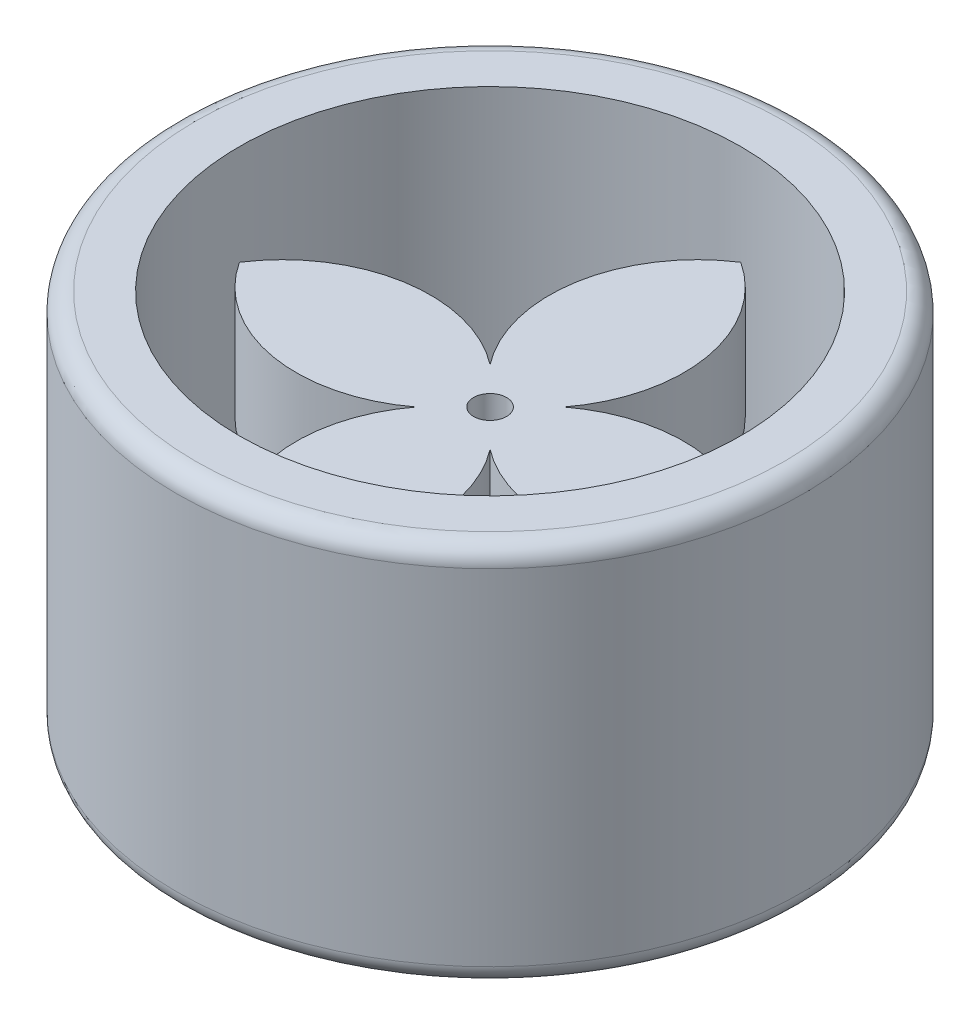
ISO-10303-21;
HEADER;
FILE_DESCRIPTION(('STEP AP214'),'2;1');
FILE_NAME('part.step','',(''),(''),'','','');
FILE_SCHEMA(('AUTOMOTIVE_DESIGN { 1 0 10303 214 1 1 1 1 }'));
ENDSEC;
DATA;
#1=APPLICATION_CONTEXT('core data for automotive mechanical design processes');
#2=APPLICATION_PROTOCOL_DEFINITION('international standard','automotive_design',2000,#1);
#3=PRODUCT_CONTEXT('',#1,'mechanical');
#4=PRODUCT('Part','Part','',(#3));
#5=PRODUCT_RELATED_PRODUCT_CATEGORY('part','',(#4));
#6=PRODUCT_DEFINITION_FORMATION('','',#4);
#7=PRODUCT_DEFINITION_CONTEXT('part definition',#1,'design');
#8=PRODUCT_DEFINITION('design','',#6,#7);
#9=PRODUCT_DEFINITION_SHAPE('','',#8);
#10=(LENGTH_UNIT() NAMED_UNIT(*) SI_UNIT(.MILLI.,.METRE.));
#11=(NAMED_UNIT(*) PLANE_ANGLE_UNIT() SI_UNIT($,.RADIAN.));
#12=(NAMED_UNIT(*) SI_UNIT($,.STERADIAN.) SOLID_ANGLE_UNIT());
#13=UNCERTAINTY_MEASURE_WITH_UNIT(LENGTH_MEASURE(1.E-05),#10,'distance_accuracy_value','');
#14=(GEOMETRIC_REPRESENTATION_CONTEXT(3) GLOBAL_UNCERTAINTY_ASSIGNED_CONTEXT((#13)) GLOBAL_UNIT_ASSIGNED_CONTEXT((#10,
#11,#12)) REPRESENTATION_CONTEXT('',''));
#15=CARTESIAN_POINT('',(0.,0.,0.));
#16=DIRECTION('',(0.,0.,1.));
#17=DIRECTION('',(1.,0.,0.));
#18=AXIS2_PLACEMENT_3D('',#15,#16,#17);
#19=CARTESIAN_POINT('',(20.2122260111009,174.137084989848,12.8907519493418));
#20=DIRECTION('',(0.,-1.,0.));
#21=DIRECTION('',(0.,0.,-1.));
#22=AXIS2_PLACEMENT_3D('',#19,#20,#21);
#23=CYLINDRICAL_SURFACE('',#22,23.6162546830612);
#24=DIRECTION('',(0.,-1.,0.));
#25=VECTOR('',#24,1.);
#26=CARTESIAN_POINT('',(5.87703014444037,174.137084989848,-5.87703014444033));
#27=LINE('',#26,#25);
#28=CARTESIAN_POINT('',(5.87703014444037,45.,-5.87703014444033));
#29=VERTEX_POINT('',#28);
#30=CARTESIAN_POINT('',(5.87703014444037,27.,-5.87703014444033));
#31=VERTEX_POINT('',#30);
#32=EDGE_CURVE('E101',#29,#31,#27,.T.);
#33=ORIENTED_EDGE('',*,*,#32,.F.);
#34=CARTESIAN_POINT('',(20.2122260111009,45.,12.8907519493418));
#35=DIRECTION('',(0.,1.,0.));
#36=DIRECTION('',(0.,0.,1.));
#37=AXIS2_PLACEMENT_3D('',#34,#35,#36);
#38=CIRCLE('',#37,23.6162546830612);
#39=CARTESIAN_POINT('',(40.,45.,0.));
#40=VERTEX_POINT('',#39);
#41=EDGE_CURVE('E156',#29,#40,#38,.F.);
#42=ORIENTED_EDGE('',*,*,#41,.T.);
#43=DIRECTION('',(0.,-1.,0.));
#44=VECTOR('',#43,1.);
#45=CARTESIAN_POINT('',(40.,174.137084989848,0.));
#46=LINE('',#45,#44);
#47=CARTESIAN_POINT('',(40.,27.,0.));
#48=VERTEX_POINT('',#47);
#49=EDGE_CURVE('E51',#40,#48,#46,.T.);
#50=ORIENTED_EDGE('',*,*,#49,.T.);
#51=CARTESIAN_POINT('',(20.2122260111009,27.,12.8907519493418));
#52=DIRECTION('',(0.,1.,0.));
#53=DIRECTION('',(0.,0.,1.));
#54=AXIS2_PLACEMENT_3D('',#51,#52,#53);
#55=CIRCLE('',#54,23.6162546830612);
#56=EDGE_CURVE('E181',#31,#48,#55,.F.);
#57=ORIENTED_EDGE('',*,*,#56,.F.);
#58=EDGE_LOOP('',(#33,#42,#50,#57));
#59=FACE_BOUND('',#58,.T.);
#60=ADVANCED_FACE('F47',(#59),#23,.T.);
#61=CARTESIAN_POINT('',(-12.8907519493418,174.137084989848,-20.2122260111009));
#62=DIRECTION('',(0.,-1.,0.));
#63=DIRECTION('',(0.,0.,-1.));
#64=AXIS2_PLACEMENT_3D('',#61,#62,#63);
#65=CYLINDRICAL_SURFACE('',#64,23.6162546830613);
#66=CARTESIAN_POINT('',(-12.8907519493418,45.,-20.2122260111009));
#67=DIRECTION('',(0.,1.,0.));
#68=DIRECTION('',(0.,0.,1.));
#69=AXIS2_PLACEMENT_3D('',#66,#67,#68);
#70=CIRCLE('',#69,23.6162546830613);
#71=CARTESIAN_POINT('',(0.,45.,-40.));
#72=VERTEX_POINT('',#71);
#73=EDGE_CURVE('E108',#29,#72,#70,.T.);
#74=ORIENTED_EDGE('',*,*,#73,.F.);
#75=ORIENTED_EDGE('',*,*,#32,.T.);
#76=CARTESIAN_POINT('',(-12.8907519493418,27.,-20.2122260111009));
#77=DIRECTION('',(0.,1.,0.));
#78=DIRECTION('',(0.,0.,1.));
#79=AXIS2_PLACEMENT_3D('',#76,#77,#78);
#80=CIRCLE('',#79,23.6162546830613);
#81=CARTESIAN_POINT('',(0.,27.,-40.));
#82=VERTEX_POINT('',#81);
#83=EDGE_CURVE('E153',#31,#82,#80,.T.);
#84=ORIENTED_EDGE('',*,*,#83,.T.);
#85=DIRECTION('',(0.,-1.,0.));
#86=VECTOR('',#85,1.);
#87=CARTESIAN_POINT('',(0.,174.137084989848,-40.));
#88=LINE('',#87,#86);
#89=EDGE_CURVE('E152',#72,#82,#88,.T.);
#90=ORIENTED_EDGE('',*,*,#89,.F.);
#91=EDGE_LOOP('',(#74,#75,#84,#90));
#92=FACE_BOUND('',#91,.T.);
#93=ADVANCED_FACE('F198',(#92),#65,.T.);
#94=CARTESIAN_POINT('',(12.8907519493418,174.137084989848,-20.2122260111009));
#95=DIRECTION('',(0.,-1.,0.));
#96=DIRECTION('',(0.,0.,-1.));
#97=AXIS2_PLACEMENT_3D('',#94,#95,#96);
#98=CYLINDRICAL_SURFACE('',#97,23.6162546830612);
#99=DIRECTION('',(0.,-1.,0.));
#100=VECTOR('',#99,1.);
#101=CARTESIAN_POINT('',(-5.87703014444033,174.137084989848,-5.87703014444033));
#102=LINE('',#101,#100);
#103=CARTESIAN_POINT('',(-5.87703014444033,45.,-5.87703014444033));
#104=VERTEX_POINT('',#103);
#105=CARTESIAN_POINT('',(-5.87703014444033,27.,-5.87703014444033));
#106=VERTEX_POINT('',#105);
#107=EDGE_CURVE('E160',#104,#106,#102,.T.);
#108=ORIENTED_EDGE('',*,*,#107,.F.);
#109=CARTESIAN_POINT('',(12.8907519493418,45.,-20.2122260111009));
#110=DIRECTION('',(0.,1.,0.));
#111=DIRECTION('',(0.,0.,1.));
#112=AXIS2_PLACEMENT_3D('',#109,#110,#111);
#113=CIRCLE('',#112,23.6162546830612);
#114=EDGE_CURVE('E150',#104,#72,#113,.F.);
#115=ORIENTED_EDGE('',*,*,#114,.T.);
#116=ORIENTED_EDGE('',*,*,#89,.T.);
#117=CARTESIAN_POINT('',(12.8907519493418,27.,-20.2122260111009));
#118=DIRECTION('',(0.,1.,0.));
#119=DIRECTION('',(0.,0.,1.));
#120=AXIS2_PLACEMENT_3D('',#117,#118,#119);
#121=CIRCLE('',#120,23.6162546830612);
#122=EDGE_CURVE('E155',#106,#82,#121,.F.);
#123=ORIENTED_EDGE('',*,*,#122,.F.);
#124=EDGE_LOOP('',(#108,#115,#116,#123));
#125=FACE_BOUND('',#124,.T.);
#126=ADVANCED_FACE('F196',(#125),#98,.T.);
#127=CARTESIAN_POINT('',(-20.2122260111009,174.137084989848,12.8907519493418));
#128=DIRECTION('',(0.,-1.,0.));
#129=DIRECTION('',(0.,0.,-1.));
#130=AXIS2_PLACEMENT_3D('',#127,#128,#129);
#131=CYLINDRICAL_SURFACE('',#130,23.6162546830612);
#132=CARTESIAN_POINT('',(-20.2122260111009,45.,12.8907519493418));
#133=DIRECTION('',(0.,1.,0.));
#134=DIRECTION('',(0.,0.,1.));
#135=AXIS2_PLACEMENT_3D('',#132,#133,#134);
#136=CIRCLE('',#135,23.6162546830612);
#137=CARTESIAN_POINT('',(-40.,45.,0.));
#138=VERTEX_POINT('',#137);
#139=EDGE_CURVE('E143',#104,#138,#136,.T.);
#140=ORIENTED_EDGE('',*,*,#139,.F.);
#141=ORIENTED_EDGE('',*,*,#107,.T.);
#142=CARTESIAN_POINT('',(-20.2122260111009,27.,12.8907519493418));
#143=DIRECTION('',(0.,1.,0.));
#144=DIRECTION('',(0.,0.,1.));
#145=AXIS2_PLACEMENT_3D('',#142,#143,#144);
#146=CIRCLE('',#145,23.6162546830612);
#147=CARTESIAN_POINT('',(-40.,27.,0.));
#148=VERTEX_POINT('',#147);
#149=EDGE_CURVE('E147',#106,#148,#146,.T.);
#150=ORIENTED_EDGE('',*,*,#149,.T.);
#151=DIRECTION('',(0.,-1.,0.));
#152=VECTOR('',#151,1.);
#153=CARTESIAN_POINT('',(-40.,174.137084989848,0.));
#154=LINE('',#153,#152);
#155=EDGE_CURVE('E146',#138,#148,#154,.T.);
#156=ORIENTED_EDGE('',*,*,#155,.F.);
#157=EDGE_LOOP('',(#140,#141,#150,#156));
#158=FACE_BOUND('',#157,.T.);
#159=ADVANCED_FACE('F200',(#158),#131,.T.);
#160=CARTESIAN_POINT('',(-20.2122260111009,174.137084989848,-12.8907519493418));
#161=DIRECTION('',(0.,-1.,0.));
#162=DIRECTION('',(0.,0.,-1.));
#163=AXIS2_PLACEMENT_3D('',#160,#161,#162);
#164=CYLINDRICAL_SURFACE('',#163,23.6162546830612);
#165=DIRECTION('',(0.,-1.,0.));
#166=VECTOR('',#165,1.);
#167=CARTESIAN_POINT('',(-5.87703014444032,174.137084989848,5.87703014444034));
#168=LINE('',#167,#166);
#169=CARTESIAN_POINT('',(-5.87703014444032,45.,5.87703014444034));
#170=VERTEX_POINT('',#169);
#171=CARTESIAN_POINT('',(-5.87703014444032,27.,5.87703014444034));
#172=VERTEX_POINT('',#171);
#173=EDGE_CURVE('E137',#170,#172,#168,.T.);
#174=ORIENTED_EDGE('',*,*,#173,.F.);
#175=CARTESIAN_POINT('',(-20.2122260111009,45.,-12.8907519493418));
#176=DIRECTION('',(0.,1.,0.));
#177=DIRECTION('',(0.,0.,1.));
#178=AXIS2_PLACEMENT_3D('',#175,#176,#177);
#179=CIRCLE('',#178,23.6162546830612);
#180=EDGE_CURVE('E144',#170,#138,#179,.F.);
#181=ORIENTED_EDGE('',*,*,#180,.T.);
#182=ORIENTED_EDGE('',*,*,#155,.T.);
#183=CARTESIAN_POINT('',(-20.2122260111009,27.,-12.8907519493418));
#184=DIRECTION('',(0.,1.,0.));
#185=DIRECTION('',(0.,0.,1.));
#186=AXIS2_PLACEMENT_3D('',#183,#184,#185);
#187=CIRCLE('',#186,23.6162546830612);
#188=EDGE_CURVE('E174',#172,#148,#187,.F.);
#189=ORIENTED_EDGE('',*,*,#188,.F.);
#190=EDGE_LOOP('',(#174,#181,#182,#189));
#191=FACE_BOUND('',#190,.T.);
#192=ADVANCED_FACE('F175',(#191),#164,.T.);
#193=CARTESIAN_POINT('',(12.8907519493419,174.137084989848,20.2122260111009));
#194=DIRECTION('',(0.,-1.,0.));
#195=DIRECTION('',(0.,0.,-1.));
#196=AXIS2_PLACEMENT_3D('',#193,#194,#195);
#197=CYLINDRICAL_SURFACE('',#196,23.6162546830612);
#198=CARTESIAN_POINT('',(12.8907519493419,45.,20.2122260111009));
#199=DIRECTION('',(0.,1.,0.));
#200=DIRECTION('',(0.,0.,1.));
#201=AXIS2_PLACEMENT_3D('',#198,#199,#200);
#202=CIRCLE('',#201,23.6162546830612);
#203=CARTESIAN_POINT('',(0.,45.,40.));
#204=VERTEX_POINT('',#203);
#205=EDGE_CURVE('E56',#170,#204,#202,.T.);
#206=ORIENTED_EDGE('',*,*,#205,.F.);
#207=ORIENTED_EDGE('',*,*,#173,.T.);
#208=CARTESIAN_POINT('',(12.8907519493419,27.,20.2122260111009));
#209=DIRECTION('',(0.,1.,0.));
#210=DIRECTION('',(0.,0.,1.));
#211=AXIS2_PLACEMENT_3D('',#208,#209,#210);
#212=CIRCLE('',#211,23.6162546830612);
#213=CARTESIAN_POINT('',(0.,27.,40.));
#214=VERTEX_POINT('',#213);
#215=EDGE_CURVE('E133',#172,#214,#212,.T.);
#216=ORIENTED_EDGE('',*,*,#215,.T.);
#217=DIRECTION('',(0.,-1.,0.));
#218=VECTOR('',#217,1.);
#219=CARTESIAN_POINT('',(0.,174.137084989848,40.));
#220=LINE('',#219,#218);
#221=EDGE_CURVE('E132',#204,#214,#220,.T.);
#222=ORIENTED_EDGE('',*,*,#221,.F.);
#223=EDGE_LOOP('',(#206,#207,#216,#222));
#224=FACE_BOUND('',#223,.T.);
#225=ADVANCED_FACE('F166',(#224),#197,.T.);
#226=CARTESIAN_POINT('',(-12.8907519493418,174.137084989848,20.2122260111009));
#227=DIRECTION('',(0.,-1.,0.));
#228=DIRECTION('',(0.,0.,-1.));
#229=AXIS2_PLACEMENT_3D('',#226,#227,#228);
#230=CYLINDRICAL_SURFACE('',#229,23.6162546830612);
#231=DIRECTION('',(0.,-1.,0.));
#232=VECTOR('',#231,1.);
#233=CARTESIAN_POINT('',(5.87703014444035,174.137084989848,5.87703014444033));
#234=LINE('',#233,#232);
#235=CARTESIAN_POINT('',(5.87703014444035,45.,5.87703014444033));
#236=VERTEX_POINT('',#235);
#237=CARTESIAN_POINT('',(5.87703014444035,27.,5.87703014444033));
#238=VERTEX_POINT('',#237);
#239=EDGE_CURVE('E69',#236,#238,#234,.T.);
#240=ORIENTED_EDGE('',*,*,#239,.F.);
#241=CARTESIAN_POINT('',(-12.8907519493418,45.,20.2122260111009));
#242=DIRECTION('',(0.,1.,0.));
#243=DIRECTION('',(0.,0.,1.));
#244=AXIS2_PLACEMENT_3D('',#241,#242,#243);
#245=CIRCLE('',#244,23.6162546830612);
#246=EDGE_CURVE('E119',#236,#204,#245,.F.);
#247=ORIENTED_EDGE('',*,*,#246,.T.);
#248=ORIENTED_EDGE('',*,*,#221,.T.);
#249=CARTESIAN_POINT('',(-12.8907519493418,27.,20.2122260111009));
#250=DIRECTION('',(0.,1.,0.));
#251=DIRECTION('',(0.,0.,1.));
#252=AXIS2_PLACEMENT_3D('',#249,#250,#251);
#253=CIRCLE('',#252,23.6162546830612);
#254=EDGE_CURVE('E124',#238,#214,#253,.F.);
#255=ORIENTED_EDGE('',*,*,#254,.F.);
#256=EDGE_LOOP('',(#240,#247,#248,#255));
#257=FACE_BOUND('',#256,.T.);
#258=ADVANCED_FACE('F122',(#257),#230,.T.);
#259=CARTESIAN_POINT('',(0.,174.137084989848,0.));
#260=DIRECTION('',(0.,-1.,0.));
#261=DIRECTION('',(0.,0.,-1.));
#262=AXIS2_PLACEMENT_3D('',#259,#260,#261);
#263=CYLINDRICAL_SURFACE('',#262,2.635);
#264=CARTESIAN_POINT('',(0.,27.,0.));
#265=DIRECTION('',(0.,1.,0.));
#266=DIRECTION('',(0.,0.,1.));
#267=AXIS2_PLACEMENT_3D('',#264,#265,#266);
#268=CIRCLE('',#267,2.635);
#269=CARTESIAN_POINT('',(0.,27.,2.635));
#270=VERTEX_POINT('',#269);
#271=EDGE_CURVE('E186',#270,#270,#268,.T.);
#272=ORIENTED_EDGE('',*,*,#271,.F.);
#273=EDGE_LOOP('',(#272));
#274=FACE_BOUND('',#273,.T.);
#275=CARTESIAN_POINT('',(0.,45.,0.));
#276=DIRECTION('',(0.,1.,0.));
#277=DIRECTION('',(0.,0.,1.));
#278=AXIS2_PLACEMENT_3D('',#275,#276,#277);
#279=CIRCLE('',#278,2.635);
#280=CARTESIAN_POINT('',(0.,45.,2.635));
#281=VERTEX_POINT('',#280);
#282=EDGE_CURVE('E126',#281,#281,#279,.T.);
#283=ORIENTED_EDGE('',*,*,#282,.T.);
#284=EDGE_LOOP('',(#283));
#285=FACE_BOUND('',#284,.T.);
#286=ADVANCED_FACE('F247',(#274,#285),#263,.F.);
#287=CARTESIAN_POINT('',(20.2122260111009,174.137084989848,-12.8907519493418));
#288=DIRECTION('',(0.,-1.,0.));
#289=DIRECTION('',(0.,0.,-1.));
#290=AXIS2_PLACEMENT_3D('',#287,#288,#289);
#291=CYLINDRICAL_SURFACE('',#290,23.6162546830612);
#292=CARTESIAN_POINT('',(20.2122260111009,45.,-12.8907519493418));
#293=DIRECTION('',(0.,1.,0.));
#294=DIRECTION('',(0.,0.,1.));
#295=AXIS2_PLACEMENT_3D('',#292,#293,#294);
#296=CIRCLE('',#295,23.6162546830612);
#297=EDGE_CURVE('E12',#236,#40,#296,.T.);
#298=ORIENTED_EDGE('',*,*,#297,.F.);
#299=ORIENTED_EDGE('',*,*,#239,.T.);
#300=CARTESIAN_POINT('',(20.2122260111009,27.,-12.8907519493418));
#301=DIRECTION('',(0.,1.,0.));
#302=DIRECTION('',(0.,0.,1.));
#303=AXIS2_PLACEMENT_3D('',#300,#301,#302);
#304=CIRCLE('',#303,23.6162546830612);
#305=EDGE_CURVE('E125',#238,#48,#304,.T.);
#306=ORIENTED_EDGE('',*,*,#305,.T.);
#307=ORIENTED_EDGE('',*,*,#49,.F.);
#308=EDGE_LOOP('',(#298,#299,#306,#307));
#309=FACE_BOUND('',#308,.T.);
#310=ADVANCED_FACE('F127',(#309),#291,.T.);
#311=CARTESIAN_POINT('',(0.,27.,0.));
#312=DIRECTION('',(0.,1.,0.));
#313=DIRECTION('',(0.,0.,1.));
#314=AXIS2_PLACEMENT_3D('',#311,#312,#313);
#315=PLANE('',#314);
#316=ORIENTED_EDGE('',*,*,#271,.T.);
#317=EDGE_LOOP('',(#316));
#318=FACE_BOUND('',#317,.T.);
#319=ORIENTED_EDGE('',*,*,#56,.T.);
#320=ORIENTED_EDGE('',*,*,#305,.F.);
#321=ORIENTED_EDGE('',*,*,#254,.T.);
#322=ORIENTED_EDGE('',*,*,#215,.F.);
#323=ORIENTED_EDGE('',*,*,#188,.T.);
#324=ORIENTED_EDGE('',*,*,#149,.F.);
#325=ORIENTED_EDGE('',*,*,#122,.T.);
#326=ORIENTED_EDGE('',*,*,#83,.F.);
#327=EDGE_LOOP('',(#319,#320,#321,#322,#323,#324,#325,#326));
#328=FACE_BOUND('',#327,.T.);
#329=ADVANCED_FACE('F172',(#318,#328),#315,.F.);
#330=CARTESIAN_POINT('',(0.,45.,0.));
#331=DIRECTION('',(0.,1.,0.));
#332=DIRECTION('',(0.,0.,1.));
#333=AXIS2_PLACEMENT_3D('',#330,#331,#332);
#334=PLANE('',#333);
#335=ORIENTED_EDGE('',*,*,#282,.F.);
#336=EDGE_LOOP('',(#335));
#337=FACE_BOUND('',#336,.T.);
#338=ORIENTED_EDGE('',*,*,#41,.F.);
#339=ORIENTED_EDGE('',*,*,#73,.T.);
#340=ORIENTED_EDGE('',*,*,#114,.F.);
#341=ORIENTED_EDGE('',*,*,#139,.T.);
#342=ORIENTED_EDGE('',*,*,#180,.F.);
#343=ORIENTED_EDGE('',*,*,#205,.T.);
#344=ORIENTED_EDGE('',*,*,#246,.F.);
#345=ORIENTED_EDGE('',*,*,#297,.T.);
#346=EDGE_LOOP('',(#338,#339,#340,#341,#342,#343,#344,#345));
#347=FACE_BOUND('',#346,.T.);
#348=ADVANCED_FACE('F49',(#337,#347),#334,.T.);
#349=CLOSED_SHELL('',(#60,#93,#126,#159,#192,#225,#258,#286,#310,#329,#348));
#350=MANIFOLD_SOLID_BREP('B2',#349);
#351=CARTESIAN_POINT('',(0.,61.,0.));
#352=DIRECTION('',(0.,-1.,0.));
#353=DIRECTION('',(0.,0.,-1.));
#354=AXIS2_PLACEMENT_3D('',#351,#352,#353);
#355=CYLINDRICAL_SURFACE('',#354,40.);
#356=CARTESIAN_POINT('',(0.,61.,0.));
#357=DIRECTION('',(0.,1.,0.));
#358=DIRECTION('',(0.,0.,1.));
#359=AXIS2_PLACEMENT_3D('',#356,#357,#358);
#360=CIRCLE('',#359,40.);
#361=CARTESIAN_POINT('',(0.,61.,40.));
#362=VERTEX_POINT('',#361);
#363=EDGE_CURVE('E320',#362,#362,#360,.T.);
#364=ORIENTED_EDGE('',*,*,#363,.T.);
#365=EDGE_LOOP('',(#364));
#366=FACE_BOUND('',#365,.T.);
#367=CARTESIAN_POINT('',(0.,0.,0.));
#368=DIRECTION('',(0.,1.,0.));
#369=DIRECTION('',(0.,0.,1.));
#370=AXIS2_PLACEMENT_3D('',#367,#368,#369);
#371=CIRCLE('',#370,40.);
#372=CARTESIAN_POINT('',(0.,0.,40.));
#373=VERTEX_POINT('',#372);
#374=EDGE_CURVE('E321',#373,#373,#371,.T.);
#375=ORIENTED_EDGE('',*,*,#374,.F.);
#376=EDGE_LOOP('',(#375));
#377=FACE_BOUND('',#376,.T.);
#378=ADVANCED_FACE('F300',(#366,#377),#355,.F.);
#379=CARTESIAN_POINT('',(0.,61.,0.));
#380=DIRECTION('',(0.,-1.,0.));
#381=DIRECTION('',(0.,0.,-1.));
#382=AXIS2_PLACEMENT_3D('',#379,#380,#381);
#383=CYLINDRICAL_SURFACE('',#382,50.);
#384=CARTESIAN_POINT('',(0.,58.,0.));
#385=DIRECTION('',(0.,1.,0.));
#386=DIRECTION('',(0.,0.,1.));
#387=AXIS2_PLACEMENT_3D('',#384,#385,#386);
#388=CIRCLE('',#387,50.);
#389=CARTESIAN_POINT('',(0.,58.,50.));
#390=VERTEX_POINT('',#389);
#391=EDGE_CURVE('E307',#390,#390,#388,.F.);
#392=ORIENTED_EDGE('',*,*,#391,.T.);
#393=EDGE_LOOP('',(#392));
#394=FACE_BOUND('',#393,.T.);
#395=CARTESIAN_POINT('',(0.,3.,0.));
#396=DIRECTION('',(0.,1.,0.));
#397=DIRECTION('',(0.,0.,1.));
#398=AXIS2_PLACEMENT_3D('',#395,#396,#397);
#399=CIRCLE('',#398,50.);
#400=CARTESIAN_POINT('',(0.,3.,50.));
#401=VERTEX_POINT('',#400);
#402=EDGE_CURVE('E311',#401,#401,#399,.T.);
#403=ORIENTED_EDGE('',*,*,#402,.T.);
#404=EDGE_LOOP('',(#403));
#405=FACE_BOUND('',#404,.T.);
#406=ADVANCED_FACE('F332',(#394,#405),#383,.T.);
#407=CARTESIAN_POINT('',(0.,61.,0.));
#408=DIRECTION('',(0.,1.,0.));
#409=DIRECTION('',(0.,0.,1.));
#410=AXIS2_PLACEMENT_3D('',#407,#408,#409);
#411=PLANE('',#410);
#412=CARTESIAN_POINT('',(0.,61.,0.));
#413=DIRECTION('',(0.,1.,0.));
#414=DIRECTION('',(0.,0.,1.));
#415=AXIS2_PLACEMENT_3D('',#412,#413,#414);
#416=CIRCLE('',#415,47.);
#417=CARTESIAN_POINT('',(0.,61.,47.));
#418=VERTEX_POINT('',#417);
#419=EDGE_CURVE('E315',#418,#418,#416,.T.);
#420=ORIENTED_EDGE('',*,*,#419,.T.);
#421=EDGE_LOOP('',(#420));
#422=FACE_BOUND('',#421,.T.);
#423=ORIENTED_EDGE('',*,*,#363,.F.);
#424=EDGE_LOOP('',(#423));
#425=FACE_BOUND('',#424,.T.);
#426=ADVANCED_FACE('F329',(#422,#425),#411,.T.);
#427=CARTESIAN_POINT('',(0.,0.,0.));
#428=DIRECTION('',(0.,1.,0.));
#429=DIRECTION('',(0.,0.,1.));
#430=AXIS2_PLACEMENT_3D('',#427,#428,#429);
#431=PLANE('',#430);
#432=CARTESIAN_POINT('',(0.,0.,0.));
#433=DIRECTION('',(0.,1.,0.));
#434=DIRECTION('',(0.,0.,1.));
#435=AXIS2_PLACEMENT_3D('',#432,#433,#434);
#436=CIRCLE('',#435,47.);
#437=CARTESIAN_POINT('',(0.,0.,47.));
#438=VERTEX_POINT('',#437);
#439=EDGE_CURVE('E46',#438,#438,#436,.F.);
#440=ORIENTED_EDGE('',*,*,#439,.T.);
#441=EDGE_LOOP('',(#440));
#442=FACE_BOUND('',#441,.T.);
#443=ORIENTED_EDGE('',*,*,#374,.T.);
#444=EDGE_LOOP('',(#443));
#445=FACE_BOUND('',#444,.T.);
#446=ADVANCED_FACE('F331',(#442,#445),#431,.F.);
#447=CARTESIAN_POINT('',(0.,58.,0.));
#448=DIRECTION('',(0.,1.,0.));
#449=DIRECTION('',(0.,0.,1.));
#450=AXIS2_PLACEMENT_3D('',#447,#448,#449);
#451=TOROIDAL_SURFACE('',#450,47.,3.);
#452=ORIENTED_EDGE('',*,*,#391,.F.);
#453=EDGE_LOOP('',(#452));
#454=FACE_BOUND('',#453,.T.);
#455=ORIENTED_EDGE('',*,*,#419,.F.);
#456=EDGE_LOOP('',(#455));
#457=FACE_BOUND('',#456,.T.);
#458=ADVANCED_FACE('F339',(#454,#457),#451,.T.);
#459=CARTESIAN_POINT('',(0.,3.,0.));
#460=DIRECTION('',(0.,1.,0.));
#461=DIRECTION('',(0.,0.,1.));
#462=AXIS2_PLACEMENT_3D('',#459,#460,#461);
#463=TOROIDAL_SURFACE('',#462,47.,3.);
#464=ORIENTED_EDGE('',*,*,#439,.F.);
#465=EDGE_LOOP('',(#464));
#466=FACE_BOUND('',#465,.T.);
#467=ORIENTED_EDGE('',*,*,#402,.F.);
#468=EDGE_LOOP('',(#467));
#469=FACE_BOUND('',#468,.T.);
#470=ADVANCED_FACE('F302',(#466,#469),#463,.T.);
#471=CLOSED_SHELL('',(#378,#406,#426,#446,#458,#470));
#472=MANIFOLD_SOLID_BREP('B6',#471);
#473=ADVANCED_BREP_SHAPE_REPRESENTATION('',(#18,#350,#472),#14);
#474=SHAPE_DEFINITION_REPRESENTATION(#9,#473);
ENDSEC;
END-ISO-10303-21;
